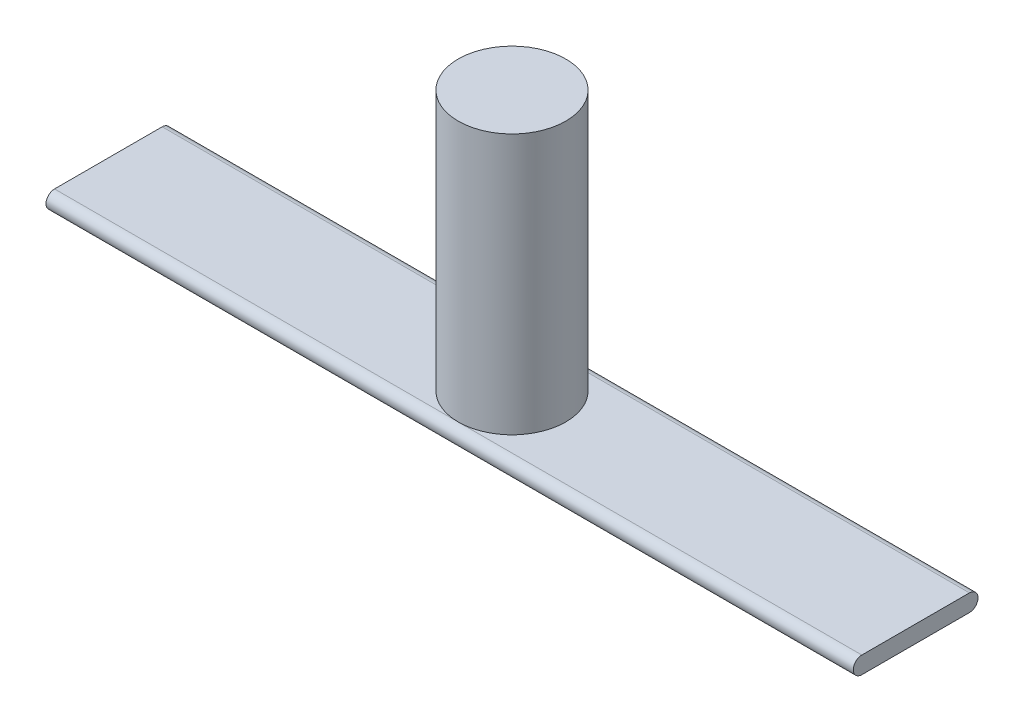
ISO-10303-21;
HEADER;
FILE_DESCRIPTION(('STEP AP214'),'2;1');
FILE_NAME('part.step','',(''),(''),'','','');
FILE_SCHEMA(('AUTOMOTIVE_DESIGN { 1 0 10303 214 1 1 1 1 }'));
ENDSEC;
DATA;
#1=APPLICATION_CONTEXT('core data for automotive mechanical design processes');
#2=APPLICATION_PROTOCOL_DEFINITION('international standard','automotive_design',2000,#1);
#3=PRODUCT_CONTEXT('',#1,'mechanical');
#4=PRODUCT('Part','Part','',(#3));
#5=PRODUCT_RELATED_PRODUCT_CATEGORY('part','',(#4));
#6=PRODUCT_DEFINITION_FORMATION('','',#4);
#7=PRODUCT_DEFINITION_CONTEXT('part definition',#1,'design');
#8=PRODUCT_DEFINITION('design','',#6,#7);
#9=PRODUCT_DEFINITION_SHAPE('','',#8);
#10=(LENGTH_UNIT() NAMED_UNIT(*) SI_UNIT(.MILLI.,.METRE.));
#11=(NAMED_UNIT(*) PLANE_ANGLE_UNIT() SI_UNIT($,.RADIAN.));
#12=(NAMED_UNIT(*) SI_UNIT($,.STERADIAN.) SOLID_ANGLE_UNIT());
#13=UNCERTAINTY_MEASURE_WITH_UNIT(LENGTH_MEASURE(1.E-05),#10,'distance_accuracy_value','');
#14=(GEOMETRIC_REPRESENTATION_CONTEXT(3) GLOBAL_UNCERTAINTY_ASSIGNED_CONTEXT((#13)) GLOBAL_UNIT_ASSIGNED_CONTEXT((#10,
#11,#12)) REPRESENTATION_CONTEXT('',''));
#15=CARTESIAN_POINT('',(0.,0.,0.));
#16=DIRECTION('',(0.,0.,1.));
#17=DIRECTION('',(1.,0.,0.));
#18=AXIS2_PLACEMENT_3D('',#15,#16,#17);
#19=CARTESIAN_POINT('',(0.,5.,0.));
#20=DIRECTION('',(0.,-1.,0.));
#21=DIRECTION('',(0.,0.,-1.));
#22=AXIS2_PLACEMENT_3D('',#19,#20,#21);
#23=CYLINDRICAL_SURFACE('',#22,1.);
#24=CARTESIAN_POINT('',(0.,5.,0.));
#25=DIRECTION('',(0.,1.,0.));
#26=DIRECTION('',(0.,0.,1.));
#27=AXIS2_PLACEMENT_3D('',#24,#25,#26);
#28=CIRCLE('',#27,1.);
#29=CARTESIAN_POINT('',(0.,5.,1.));
#30=VERTEX_POINT('',#29);
#31=EDGE_CURVE('E98',#30,#30,#28,.T.);
#32=ORIENTED_EDGE('',*,*,#31,.F.);
#33=EDGE_LOOP('',(#32));
#34=FACE_BOUND('',#33,.T.);
#35=CARTESIAN_POINT('',(0.,0.158659907530279,0.));
#36=DIRECTION('',(0.,-1.,0.));
#37=DIRECTION('',(0.,0.,-1.));
#38=AXIS2_PLACEMENT_3D('',#35,#36,#37);
#39=CIRCLE('',#38,1.);
#40=CARTESIAN_POINT('',(0.,0.158659907530279,-1.));
#41=VERTEX_POINT('',#40);
#42=CARTESIAN_POINT('',(0.,0.158659907530279,1.));
#43=VERTEX_POINT('',#42);
#44=EDGE_CURVE('E11',#41,#43,#39,.T.);
#45=ORIENTED_EDGE('',*,*,#44,.F.);
#46=EDGE_CURVE('E36',#43,#41,#39,.T.);
#47=ORIENTED_EDGE('',*,*,#46,.F.);
#48=EDGE_LOOP('',(#45,#47));
#49=FACE_BOUND('',#48,.T.);
#50=ADVANCED_FACE('F33',(#34,#49),#23,.T.);
#51=CARTESIAN_POINT('',(0.,5.,0.));
#52=DIRECTION('',(0.,1.,0.));
#53=DIRECTION('',(0.,0.,1.));
#54=AXIS2_PLACEMENT_3D('',#51,#52,#53);
#55=PLANE('',#54);
#56=ORIENTED_EDGE('',*,*,#31,.T.);
#57=EDGE_LOOP('',(#56));
#58=FACE_BOUND('',#57,.T.);
#59=ADVANCED_FACE('F140',(#58),#55,.T.);
#60=CARTESIAN_POINT('',(7.5,0.158659907530279,1.));
#61=DIRECTION('',(0.,-1.,0.));
#62=DIRECTION('',(0.,0.,-1.));
#63=AXIS2_PLACEMENT_3D('',#60,#61,#62);
#64=PLANE('',#63);
#65=DIRECTION('',(-1.,0.,0.));
#66=VECTOR('',#65,1.);
#67=CARTESIAN_POINT('',(7.5,0.158659907530279,-1.));
#68=LINE('',#67,#66);
#69=CARTESIAN_POINT('',(7.5,0.158659907530279,-1.));
#70=VERTEX_POINT('',#69);
#71=EDGE_CURVE('E101',#70,#41,#68,.T.);
#72=ORIENTED_EDGE('',*,*,#71,.T.);
#73=ORIENTED_EDGE('',*,*,#44,.T.);
#74=DIRECTION('',(-1.,0.,0.));
#75=VECTOR('',#74,1.);
#76=CARTESIAN_POINT('',(7.5,0.158659907530279,1.));
#77=LINE('',#76,#75);
#78=CARTESIAN_POINT('',(7.5,0.158659907530279,1.));
#79=VERTEX_POINT('',#78);
#80=EDGE_CURVE('E107',#79,#43,#77,.T.);
#81=ORIENTED_EDGE('',*,*,#80,.F.);
#82=DIRECTION('',(0.,0.,1.));
#83=VECTOR('',#82,1.);
#84=CARTESIAN_POINT('',(7.5,0.158659907530279,1.));
#85=LINE('',#84,#83);
#86=EDGE_CURVE('E89',#70,#79,#85,.T.);
#87=ORIENTED_EDGE('',*,*,#86,.F.);
#88=EDGE_LOOP('',(#72,#73,#81,#87));
#89=FACE_BOUND('',#88,.T.);
#90=ADVANCED_FACE('F124',(#89),#64,.F.);
#91=CARTESIAN_POINT('',(7.5,0.,1.));
#92=DIRECTION('',(-1.,0.,0.));
#93=DIRECTION('',(0.,0.,1.));
#94=AXIS2_PLACEMENT_3D('',#91,#92,#93);
#95=CYLINDRICAL_SURFACE('',#94,0.158659907530279);
#96=CARTESIAN_POINT('',(-7.5,0.,1.));
#97=DIRECTION('',(1.,0.,0.));
#98=DIRECTION('',(0.,0.,-1.));
#99=AXIS2_PLACEMENT_3D('',#96,#97,#98);
#100=CIRCLE('',#99,0.158659907530279);
#101=CARTESIAN_POINT('',(-7.5,0.158659907530279,1.));
#102=VERTEX_POINT('',#101);
#103=CARTESIAN_POINT('',(-7.5,-0.158659907530279,1.));
#104=VERTEX_POINT('',#103);
#105=EDGE_CURVE('E97',#102,#104,#100,.T.);
#106=ORIENTED_EDGE('',*,*,#105,.T.);
#107=DIRECTION('',(-1.,0.,0.));
#108=VECTOR('',#107,1.);
#109=CARTESIAN_POINT('',(7.5,-0.158659907530279,1.));
#110=LINE('',#109,#108);
#111=CARTESIAN_POINT('',(7.5,-0.158659907530279,1.));
#112=VERTEX_POINT('',#111);
#113=EDGE_CURVE('E77',#112,#104,#110,.T.);
#114=ORIENTED_EDGE('',*,*,#113,.F.);
#115=CARTESIAN_POINT('',(7.5,0.,1.));
#116=DIRECTION('',(1.,0.,0.));
#117=DIRECTION('',(0.,0.,-1.));
#118=AXIS2_PLACEMENT_3D('',#115,#116,#117);
#119=CIRCLE('',#118,0.158659907530279);
#120=EDGE_CURVE('E84',#79,#112,#119,.T.);
#121=ORIENTED_EDGE('',*,*,#120,.F.);
#122=ORIENTED_EDGE('',*,*,#80,.T.);
#123=EDGE_CURVE('E109',#43,#102,#77,.T.);
#124=ORIENTED_EDGE('',*,*,#123,.T.);
#125=EDGE_LOOP('',(#106,#114,#121,#122,#124));
#126=FACE_BOUND('',#125,.T.);
#127=ADVANCED_FACE('F95',(#126),#95,.T.);
#128=CARTESIAN_POINT('',(7.5,-0.158659907530279,1.));
#129=DIRECTION('',(0.,1.,0.));
#130=DIRECTION('',(0.,0.,1.));
#131=AXIS2_PLACEMENT_3D('',#128,#129,#130);
#132=PLANE('',#131);
#133=DIRECTION('',(0.,0.,-1.));
#134=VECTOR('',#133,1.);
#135=CARTESIAN_POINT('',(-7.5,-0.158659907530279,1.));
#136=LINE('',#135,#134);
#137=CARTESIAN_POINT('',(-7.5,-0.158659907530279,-1.));
#138=VERTEX_POINT('',#137);
#139=EDGE_CURVE('E115',#104,#138,#136,.T.);
#140=ORIENTED_EDGE('',*,*,#139,.T.);
#141=DIRECTION('',(-1.,0.,0.));
#142=VECTOR('',#141,1.);
#143=CARTESIAN_POINT('',(7.5,-0.158659907530279,-1.));
#144=LINE('',#143,#142);
#145=CARTESIAN_POINT('',(7.5,-0.158659907530279,-1.));
#146=VERTEX_POINT('',#145);
#147=EDGE_CURVE('E80',#146,#138,#144,.T.);
#148=ORIENTED_EDGE('',*,*,#147,.F.);
#149=DIRECTION('',(0.,0.,-1.));
#150=VECTOR('',#149,1.);
#151=CARTESIAN_POINT('',(7.5,-0.158659907530279,1.));
#152=LINE('',#151,#150);
#153=EDGE_CURVE('E73',#112,#146,#152,.T.);
#154=ORIENTED_EDGE('',*,*,#153,.F.);
#155=ORIENTED_EDGE('',*,*,#113,.T.);
#156=EDGE_LOOP('',(#140,#148,#154,#155));
#157=FACE_BOUND('',#156,.T.);
#158=ADVANCED_FACE('F75',(#157),#132,.F.);
#159=CARTESIAN_POINT('',(7.5,0.,-1.));
#160=DIRECTION('',(-1.,0.,0.));
#161=DIRECTION('',(0.,0.,1.));
#162=AXIS2_PLACEMENT_3D('',#159,#160,#161);
#163=CYLINDRICAL_SURFACE('',#162,0.158659907530279);
#164=CARTESIAN_POINT('',(-7.5,0.,-1.));
#165=DIRECTION('',(1.,0.,0.));
#166=DIRECTION('',(0.,0.,-1.));
#167=AXIS2_PLACEMENT_3D('',#164,#165,#166);
#168=CIRCLE('',#167,0.158659907530279);
#169=CARTESIAN_POINT('',(-7.5,0.158659907530279,-1.));
#170=VERTEX_POINT('',#169);
#171=EDGE_CURVE('E112',#138,#170,#168,.T.);
#172=ORIENTED_EDGE('',*,*,#171,.T.);
#173=EDGE_CURVE('E106',#41,#170,#68,.T.);
#174=ORIENTED_EDGE('',*,*,#173,.F.);
#175=ORIENTED_EDGE('',*,*,#71,.F.);
#176=CARTESIAN_POINT('',(7.5,0.,-1.));
#177=DIRECTION('',(1.,0.,0.));
#178=DIRECTION('',(0.,0.,-1.));
#179=AXIS2_PLACEMENT_3D('',#176,#177,#178);
#180=CIRCLE('',#179,0.158659907530279);
#181=EDGE_CURVE('E83',#146,#70,#180,.T.);
#182=ORIENTED_EDGE('',*,*,#181,.F.);
#183=ORIENTED_EDGE('',*,*,#147,.T.);
#184=EDGE_LOOP('',(#172,#174,#175,#182,#183));
#185=FACE_BOUND('',#184,.T.);
#186=ADVANCED_FACE('F122',(#185),#163,.T.);
#187=ORIENTED_EDGE('',*,*,#123,.F.);
#188=ORIENTED_EDGE('',*,*,#46,.T.);
#189=ORIENTED_EDGE('',*,*,#173,.T.);
#190=DIRECTION('',(0.,0.,1.));
#191=VECTOR('',#190,1.);
#192=CARTESIAN_POINT('',(-7.5,0.158659907530279,1.));
#193=LINE('',#192,#191);
#194=EDGE_CURVE('E93',#170,#102,#193,.T.);
#195=ORIENTED_EDGE('',*,*,#194,.T.);
#196=EDGE_LOOP('',(#187,#188,#189,#195));
#197=FACE_BOUND('',#196,.T.);
#198=ADVANCED_FACE('F128',(#197),#64,.F.);
#199=CARTESIAN_POINT('',(7.5,0.,1.));
#200=DIRECTION('',(1.,0.,0.));
#201=DIRECTION('',(0.,0.,-1.));
#202=AXIS2_PLACEMENT_3D('',#199,#200,#201);
#203=PLANE('',#202);
#204=ORIENTED_EDGE('',*,*,#120,.T.);
#205=ORIENTED_EDGE('',*,*,#153,.T.);
#206=ORIENTED_EDGE('',*,*,#181,.T.);
#207=ORIENTED_EDGE('',*,*,#86,.T.);
#208=EDGE_LOOP('',(#204,#205,#206,#207));
#209=FACE_BOUND('',#208,.T.);
#210=ADVANCED_FACE('F87',(#209),#203,.T.);
#211=CARTESIAN_POINT('',(-7.5,0.,1.));
#212=DIRECTION('',(1.,0.,0.));
#213=DIRECTION('',(0.,0.,-1.));
#214=AXIS2_PLACEMENT_3D('',#211,#212,#213);
#215=PLANE('',#214);
#216=ORIENTED_EDGE('',*,*,#105,.F.);
#217=ORIENTED_EDGE('',*,*,#194,.F.);
#218=ORIENTED_EDGE('',*,*,#171,.F.);
#219=ORIENTED_EDGE('',*,*,#139,.F.);
#220=EDGE_LOOP('',(#216,#217,#218,#219));
#221=FACE_BOUND('',#220,.T.);
#222=ADVANCED_FACE('F131',(#221),#215,.F.);
#223=CLOSED_SHELL('',(#50,#59,#90,#127,#158,#186,#198,#210,#222));
#224=MANIFOLD_SOLID_BREP('B2',#223);
#225=ADVANCED_BREP_SHAPE_REPRESENTATION('',(#18,#224),#14);
#226=SHAPE_DEFINITION_REPRESENTATION(#9,#225);
ENDSEC;
END-ISO-10303-21;
